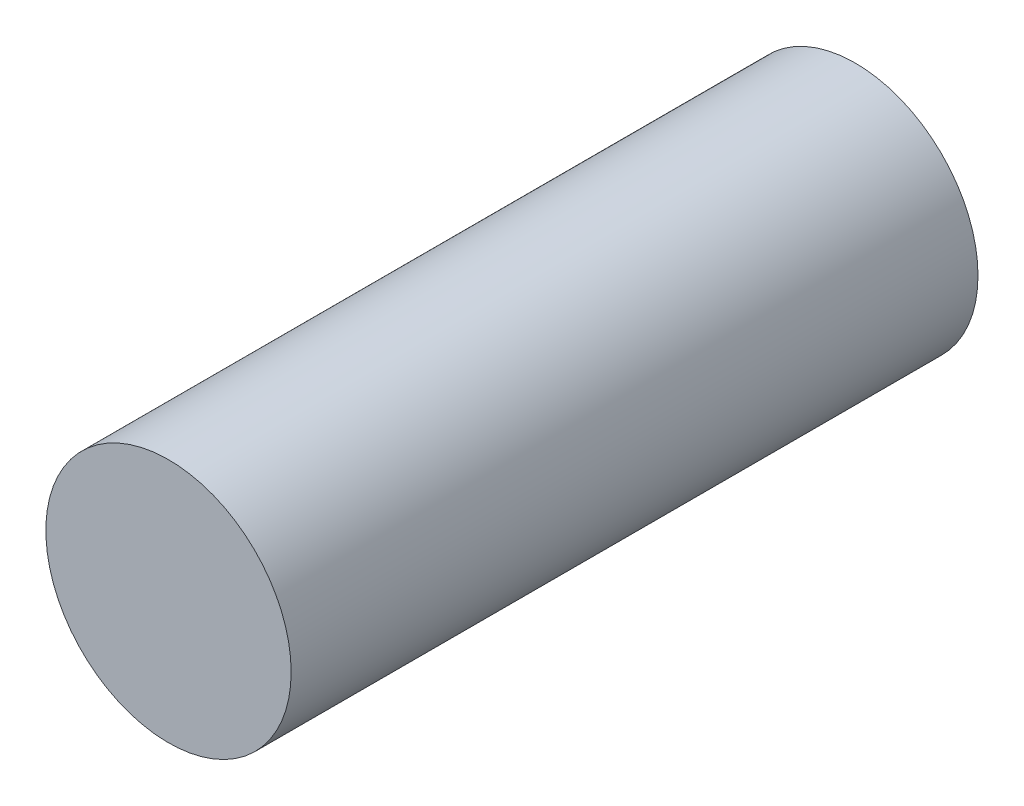
ISO-10303-21;
HEADER;
FILE_DESCRIPTION(('STEP AP214'),'2;1');
FILE_NAME('part.step','',(''),(''),'','','');
FILE_SCHEMA(('AUTOMOTIVE_DESIGN { 1 0 10303 214 1 1 1 1 }'));
ENDSEC;
DATA;
#1=APPLICATION_CONTEXT('core data for automotive mechanical design processes');
#2=APPLICATION_PROTOCOL_DEFINITION('international standard','automotive_design',2000,#1);
#3=PRODUCT_CONTEXT('',#1,'mechanical');
#4=PRODUCT('Part','Part','',(#3));
#5=PRODUCT_RELATED_PRODUCT_CATEGORY('part','',(#4));
#6=PRODUCT_DEFINITION_FORMATION('','',#4);
#7=PRODUCT_DEFINITION_CONTEXT('part definition',#1,'design');
#8=PRODUCT_DEFINITION('design','',#6,#7);
#9=PRODUCT_DEFINITION_SHAPE('','',#8);
#10=(LENGTH_UNIT() NAMED_UNIT(*) SI_UNIT(.MILLI.,.METRE.));
#11=(NAMED_UNIT(*) PLANE_ANGLE_UNIT() SI_UNIT($,.RADIAN.));
#12=(NAMED_UNIT(*) SI_UNIT($,.STERADIAN.) SOLID_ANGLE_UNIT());
#13=UNCERTAINTY_MEASURE_WITH_UNIT(LENGTH_MEASURE(1.E-05),#10,'distance_accuracy_value','');
#14=(GEOMETRIC_REPRESENTATION_CONTEXT(3) GLOBAL_UNCERTAINTY_ASSIGNED_CONTEXT((#13)) GLOBAL_UNIT_ASSIGNED_CONTEXT((#10,
#11,#12)) REPRESENTATION_CONTEXT('',''));
#15=CARTESIAN_POINT('',(0.,0.,0.));
#16=DIRECTION('',(0.,0.,1.));
#17=DIRECTION('',(1.,0.,0.));
#18=AXIS2_PLACEMENT_3D('',#15,#16,#17);
#19=CARTESIAN_POINT('',(0.,0.,70.));
#20=DIRECTION('',(0.,0.,-1.));
#21=DIRECTION('',(-1.,0.,0.));
#22=AXIS2_PLACEMENT_3D('',#19,#20,#21);
#23=CYLINDRICAL_SURFACE('',#22,12.5);
#24=CARTESIAN_POINT('',(0.,0.,70.));
#25=DIRECTION('',(0.,0.,1.));
#26=DIRECTION('',(1.,0.,0.));
#27=AXIS2_PLACEMENT_3D('',#24,#25,#26);
#28=CIRCLE('',#27,12.5);
#29=CARTESIAN_POINT('',(12.5,0.,70.));
#30=VERTEX_POINT('',#29);
#31=EDGE_CURVE('E10',#30,#30,#28,.T.);
#32=ORIENTED_EDGE('',*,*,#31,.F.);
#33=EDGE_LOOP('',(#32));
#34=FACE_BOUND('',#33,.T.);
#35=CARTESIAN_POINT('',(0.,0.,0.));
#36=DIRECTION('',(0.,0.,1.));
#37=DIRECTION('',(1.,0.,0.));
#38=AXIS2_PLACEMENT_3D('',#35,#36,#37);
#39=CIRCLE('',#38,12.5);
#40=CARTESIAN_POINT('',(12.5,0.,0.));
#41=VERTEX_POINT('',#40);
#42=EDGE_CURVE('E40',#41,#41,#39,.T.);
#43=ORIENTED_EDGE('',*,*,#42,.T.);
#44=EDGE_LOOP('',(#43));
#45=FACE_BOUND('',#44,.T.);
#46=ADVANCED_FACE('F37',(#34,#45),#23,.T.);
#47=CARTESIAN_POINT('',(0.,0.,70.));
#48=DIRECTION('',(0.,0.,1.));
#49=DIRECTION('',(1.,0.,0.));
#50=AXIS2_PLACEMENT_3D('',#47,#48,#49);
#51=PLANE('',#50);
#52=ORIENTED_EDGE('',*,*,#31,.T.);
#53=EDGE_LOOP('',(#52));
#54=FACE_BOUND('',#53,.T.);
#55=ADVANCED_FACE('F54',(#54),#51,.T.);
#56=CARTESIAN_POINT('',(0.,0.,0.));
#57=DIRECTION('',(0.,0.,1.));
#58=DIRECTION('',(1.,0.,0.));
#59=AXIS2_PLACEMENT_3D('',#56,#57,#58);
#60=PLANE('',#59);
#61=ORIENTED_EDGE('',*,*,#42,.F.);
#62=EDGE_LOOP('',(#61));
#63=FACE_BOUND('',#62,.T.);
#64=ADVANCED_FACE('F52',(#63),#60,.F.);
#65=CLOSED_SHELL('',(#46,#55,#64));
#66=MANIFOLD_SOLID_BREP('B2',#65);
#67=ADVANCED_BREP_SHAPE_REPRESENTATION('',(#18,#66),#14);
#68=SHAPE_DEFINITION_REPRESENTATION(#9,#67);
ENDSEC;
END-ISO-10303-21;
